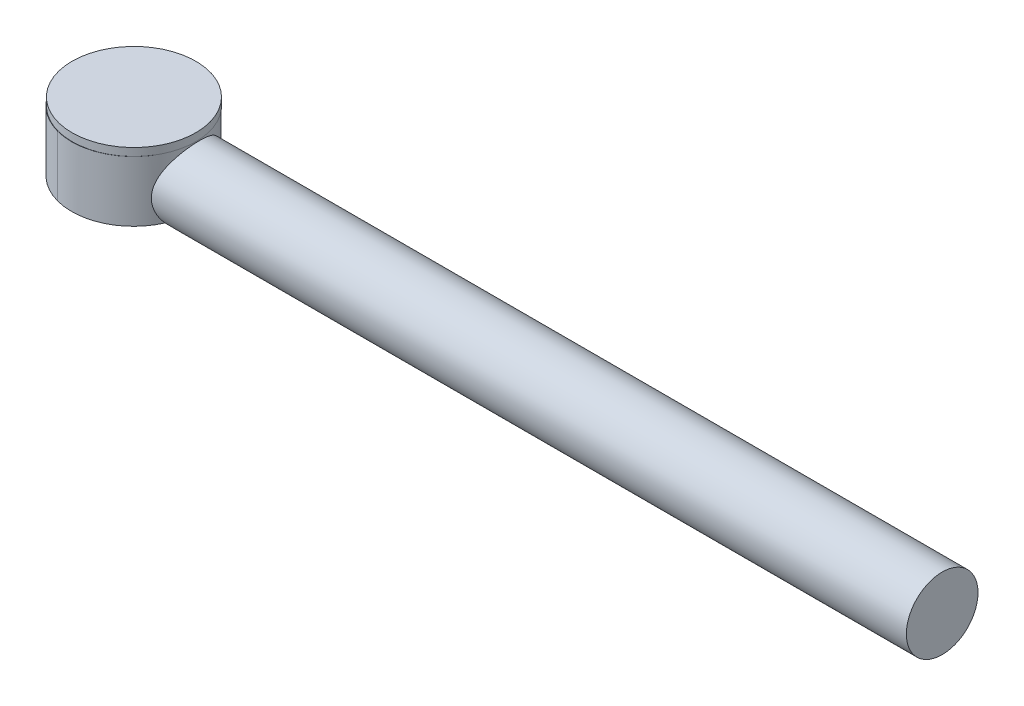
ISO-10303-21;
HEADER;
FILE_DESCRIPTION(('STEP AP214'),'2;1');
FILE_NAME('part.step','',(''),(''),'','','');
FILE_SCHEMA(('AUTOMOTIVE_DESIGN { 1 0 10303 214 1 1 1 1 }'));
ENDSEC;
DATA;
#1=APPLICATION_CONTEXT('core data for automotive mechanical design processes');
#2=APPLICATION_PROTOCOL_DEFINITION('international standard','automotive_design',2000,#1);
#3=PRODUCT_CONTEXT('',#1,'mechanical');
#4=PRODUCT('Part','Part','',(#3));
#5=PRODUCT_RELATED_PRODUCT_CATEGORY('part','',(#4));
#6=PRODUCT_DEFINITION_FORMATION('','',#4);
#7=PRODUCT_DEFINITION_CONTEXT('part definition',#1,'design');
#8=PRODUCT_DEFINITION('design','',#6,#7);
#9=PRODUCT_DEFINITION_SHAPE('','',#8);
#10=(LENGTH_UNIT() NAMED_UNIT(*) SI_UNIT(.MILLI.,.METRE.));
#11=(NAMED_UNIT(*) PLANE_ANGLE_UNIT() SI_UNIT($,.RADIAN.));
#12=(NAMED_UNIT(*) SI_UNIT($,.STERADIAN.) SOLID_ANGLE_UNIT());
#13=UNCERTAINTY_MEASURE_WITH_UNIT(LENGTH_MEASURE(1.E-05),#10,'distance_accuracy_value','');
#14=(GEOMETRIC_REPRESENTATION_CONTEXT(3) GLOBAL_UNCERTAINTY_ASSIGNED_CONTEXT((#13)) GLOBAL_UNIT_ASSIGNED_CONTEXT((#10,
#11,#12)) REPRESENTATION_CONTEXT('',''));
#15=CARTESIAN_POINT('',(0.,0.,0.));
#16=DIRECTION('',(0.,0.,1.));
#17=DIRECTION('',(1.,0.,0.));
#18=AXIS2_PLACEMENT_3D('',#15,#16,#17);
#19=CARTESIAN_POINT('',(85.8455921537652,56.2711130740514,55.1663814754269));
#20=DIRECTION('',(0.,-1.,0.));
#21=DIRECTION('',(0.,0.,-1.));
#22=AXIS2_PLACEMENT_3D('',#19,#20,#21);
#23=PLANE('',#22);
#24=CARTESIAN_POINT('',(85.8451387170964,56.2711130740514,55.1680444543631));
#25=DIRECTION('',(0.,1.,0.));
#26=DIRECTION('',(0.,0.,1.));
#27=AXIS2_PLACEMENT_3D('',#24,#25,#26);
#28=CIRCLE('',#27,0.00172368899597669);
#29=CARTESIAN_POINT('',(85.8451387170964,56.2711130740514,55.1697681433591));
#30=VERTEX_POINT('',#29);
#31=EDGE_CURVE('E141',#30,#30,#28,.T.);
#32=ORIENTED_EDGE('',*,*,#31,.F.);
#33=EDGE_LOOP('',(#32));
#34=FACE_BOUND('',#33,.T.);
#35=ADVANCED_FACE('F39',(#34),#23,.T.);
#36=CARTESIAN_POINT('',(85.8455921537652,56.2711130740514,55.1663814754269));
#37=DIRECTION('',(0.,-1.,0.));
#38=DIRECTION('',(0.,0.,-1.));
#39=AXIS2_PLACEMENT_3D('',#36,#37,#38);
#40=CYLINDRICAL_SURFACE('',#39,3.46216045673487);
#41=CARTESIAN_POINT('',(85.8455921537652,56.2711130740514,55.1663814754269));
#42=DIRECTION('',(0.,1.,0.));
#43=DIRECTION('',(0.263061764545742,0.,-0.964778994399277));
#44=AXIS2_PLACEMENT_3D('',#41,#42,#43);
#45=CIRCLE('',#44,3.46216045673486);
#46=CARTESIAN_POINT('',(86.7563541926543,56.2711130740514,51.8261617915293));
#47=VERTEX_POINT('',#46);
#48=EDGE_CURVE('E49',#47,#47,#45,.T.);
#49=ORIENTED_EDGE('',*,*,#48,.T.);
#50=EDGE_LOOP('',(#49));
#51=FACE_BOUND('',#50,.T.);
#52=CARTESIAN_POINT('',(85.8451387170964,52.6498767005646,58.6319286000939));
#53=CARTESIAN_POINT('',(85.9022781431992,52.6498767005646,58.6319330171962));
#54=CARTESIAN_POINT('',(85.9594204812359,52.6498767005646,58.6305673819269));
#55=CARTESIAN_POINT('',(86.0731646435422,52.6498767005646,58.6250696449926));
#56=CARTESIAN_POINT('',(86.1297674244005,52.6498767005646,58.6209572593628));
#57=CARTESIAN_POINT('',(86.242433194291,52.6498767005646,58.6099670734729));
#58=CARTESIAN_POINT('',(86.2984974702433,52.6498767005646,58.6031025163872));
#59=CARTESIAN_POINT('',(86.4100855726197,52.6498767005646,58.5866160643179));
#60=CARTESIAN_POINT('',(86.4656103551575,52.6498767005646,58.577000643534));
#61=CARTESIAN_POINT('',(86.5761200276653,52.6498767005646,58.5550189255727));
#62=CARTESIAN_POINT('',(86.6311048484214,52.6498767005646,58.5426522804193));
#63=CARTESIAN_POINT('',(86.7405357546421,52.6498767005646,58.5151752339513));
#64=CARTESIAN_POINT('',(86.7949800745156,52.6498767005646,58.5000578046358));
#65=CARTESIAN_POINT('',(86.9033316769709,52.6498767005646,58.4670852210716));
#66=CARTESIAN_POINT('',(86.9572348863243,52.6498767005646,58.4492166918067));
#67=CARTESIAN_POINT('',(87.0645071672621,52.6498767005646,58.4107503889644));
#68=CARTESIAN_POINT('',(87.1178693461341,52.6498767005646,58.3901334190223));
#69=CARTESIAN_POINT('',(87.2234828832721,52.6498767005646,58.3464067061153));
#70=CARTESIAN_POINT('',(87.2757355707485,52.6498767005646,58.3233001740664));
#71=CARTESIAN_POINT('',(87.3786873165212,52.6498767005646,58.2747271425663));
#72=CARTESIAN_POINT('',(87.4293946827911,52.6498767005646,58.2492782721121));
#73=CARTESIAN_POINT('',(87.5292579193038,52.6498767005646,58.1960289301901));
#74=CARTESIAN_POINT('',(87.5784198944581,52.6498767005646,58.1682399124995));
#75=CARTESIAN_POINT('',(87.6751945823478,52.6498767005646,58.1103159826552));
#76=CARTESIAN_POINT('',(87.7228104810345,52.6498767005646,58.0801863947181));
#77=CARTESIAN_POINT('',(87.8164960939139,52.6498767005646,58.0175876208643));
#78=CARTESIAN_POINT('',(87.8625654138706,52.6498767005646,57.9851178449527));
#79=CARTESIAN_POINT('',(87.953161687794,52.6498767005646,57.9178447103025));
#80=CARTESIAN_POINT('',(87.9976841056925,52.6498767005646,57.8830352444508));
#81=CARTESIAN_POINT('',(88.0851903880118,52.6498767005646,57.8110875939322));
#82=CARTESIAN_POINT('',(88.1281651419152,52.6498767005646,57.7739383335595));
#83=CARTESIAN_POINT('',(88.2125823553953,52.6498767005646,57.6973181266199));
#84=CARTESIAN_POINT('',(88.2540108672816,52.6498767005646,57.6578318261505));
#85=CARTESIAN_POINT('',(88.3348689748557,52.6498767005646,57.5769985280609));
#86=CARTESIAN_POINT('',(88.3743018829821,52.6498767005646,57.5356548442848));
#87=CARTESIAN_POINT('',(88.4508289493643,52.6498767005646,57.4513814368172));
#88=CARTESIAN_POINT('',(88.4879375313423,52.6498767005646,57.4084648226967));
#89=CARTESIAN_POINT('',(88.5598214507882,52.6498767005646,57.321052799695));
#90=CARTESIAN_POINT('',(88.5946068113079,52.6498767005646,57.2765656361548));
#91=CARTESIAN_POINT('',(88.6618484470639,52.6498767005646,57.1860168438093));
#92=CARTESIAN_POINT('',(88.6943097032658,52.6498767005646,57.1399589147686));
#93=CARTESIAN_POINT('',(88.7569084070072,52.6498767005646,57.0462732541047));
#94=CARTESIAN_POINT('',(88.7870452645401,52.6498767005646,56.9986451282661));
#95=CARTESIAN_POINT('',(88.8450009944314,52.6498767005646,56.9018231637735));
#96=CARTESIAN_POINT('',(88.8728133389145,52.6498767005646,56.8526254187572));
#97=CARTESIAN_POINT('',(88.9261254280582,52.6498767005646,56.7526672523529));
#98=CARTESIAN_POINT('',(88.9516125172107,52.6498767005646,56.7019000847931));
#99=CARTESIAN_POINT('',(89.0002825692125,52.6498767005646,56.5988071748745));
#100=CARTESIAN_POINT('',(89.0234467703912,52.6498767005646,56.5464725849089));
#101=CARTESIAN_POINT('',(89.0672163570395,52.6498767005646,56.4408492971016));
#102=CARTESIAN_POINT('',(89.0878260709565,52.6498767005646,56.3875623932372));
#103=CARTESIAN_POINT('',(89.1262778244476,52.6498767005646,56.280418276514));
#104=CARTESIAN_POINT('',(89.1441382066191,52.6498767005646,56.2265676556));
#105=CARTESIAN_POINT('',(89.1770991555188,52.6498767005646,56.1183006916261));
#106=CARTESIAN_POINT('',(89.1922121376947,52.6498767005646,56.0638881306124));
#107=CARTESIAN_POINT('',(89.2196837860514,52.6498767005646,55.9544996947017));
#108=CARTESIAN_POINT('',(89.2320484698829,52.6498767005646,55.8995253318088));
#109=CARTESIAN_POINT('',(89.254030180845,52.6498767005646,55.7890155806221));
#110=CARTESIAN_POINT('',(89.2636465120209,52.6498767005646,55.7334800539067));
#111=CARTESIAN_POINT('',(89.2801384629587,52.6498767005646,55.6218495249747));
#112=CARTESIAN_POINT('',(89.2870065568503,52.6498767005646,55.5657534118598));
#113=CARTESIAN_POINT('',(89.2980081706328,52.6498767005646,55.4530024545521));
#114=CARTESIAN_POINT('',(89.3021274167108,52.6498767005646,55.3963462207625));
#115=CARTESIAN_POINT('',(89.307640732981,52.6498767005646,55.2824755687892));
#116=CARTESIAN_POINT('',(89.3090140838173,52.6498767005646,55.2252601562631));
#117=CARTESIAN_POINT('',(89.309031626752,52.6498767005646,55.1109270668505));
#118=CARTESIAN_POINT('',(89.3076805043397,52.6498767005646,55.0538093909576));
#119=CARTESIAN_POINT('',(89.3022030140336,52.6498767005646,54.9401062854821));
#120=CARTESIAN_POINT('',(89.2980961151182,52.6498767005646,54.8835199266539));
#121=CARTESIAN_POINT('',(89.2871160877933,52.6498767005646,54.7708806855327));
#122=CARTESIAN_POINT('',(89.2802558770882,52.6498767005646,54.7148265462084));
#123=CARTESIAN_POINT('',(89.2637752286139,52.6498767005646,54.6032518644914));
#124=CARTESIAN_POINT('',(89.2541609290478,52.6498767005646,54.547730416153));
#125=CARTESIAN_POINT('',(89.2321791310013,52.6498767005646,54.4372206822885));
#126=CARTESIAN_POINT('',(89.2198109365709,52.6498767005646,54.3822325352077));
#127=CARTESIAN_POINT('',(89.1923283585253,52.6498767005646,54.2727881779326));
#128=CARTESIAN_POINT('',(89.17720659679,52.6498767005646,54.2183338214279));
#129=CARTESIAN_POINT('',(89.1442228392435,52.6498767005646,54.1099553843763));
#130=CARTESIAN_POINT('',(89.1263471243729,52.6498767005646,54.0560354823608));
#131=CARTESIAN_POINT('',(89.0878643524888,52.6498767005646,53.9487228628546));
#132=CARTESIAN_POINT('',(89.067237772768,52.6498767005646,53.8953371556654));
#133=CARTESIAN_POINT('',(89.0235006012374,52.6498767005646,53.7897004410775));
#134=CARTESIAN_POINT('',(89.0003943386356,52.6498767005646,53.7374476415377));
#135=CARTESIAN_POINT('',(88.9518215027788,52.6498767005646,53.6344958143968));
#136=CARTESIAN_POINT('',(88.9263725609076,52.6498767005646,53.5837884778295));
#137=CARTESIAN_POINT('',(88.8731231669847,52.6498767005646,53.4839252629441));
#138=CARTESIAN_POINT('',(88.8453341682908,52.6498767005646,53.4347632798891));
#139=CARTESIAN_POINT('',(88.7874102523185,52.6498767005646,53.3379885862301));
#140=CARTESIAN_POINT('',(88.75728065931,52.6498767005646,53.2903726896526));
#141=CARTESIAN_POINT('',(88.694681881742,52.6498767005646,53.196687078318));
#142=CARTESIAN_POINT('',(88.6622121071893,52.6498767005646,53.1506177577961));
#143=CARTESIAN_POINT('',(88.5949389735371,52.6498767005646,53.0600214834575));
#144=CARTESIAN_POINT('',(88.5601295073198,52.6498767005646,53.0154990657111));
#145=CARTESIAN_POINT('',(88.4881818565317,52.6498767005646,52.9279927835037));
#146=CARTESIAN_POINT('',(88.4510325962575,52.6498767005646,52.8850180295593));
#147=CARTESIAN_POINT('',(88.3744123893903,52.6498767005646,52.8006008160489));
#148=CARTESIAN_POINT('',(88.3349260888938,52.6498767005646,52.7591723041737));
#149=CARTESIAN_POINT('',(88.2540927907836,52.6498767005646,52.6783141966072));
#150=CARTESIAN_POINT('',(88.2127491070137,52.6498767005646,52.6388812884772));
#151=CARTESIAN_POINT('',(88.1284756995498,52.6498767005646,52.5623542220918));
#152=CARTESIAN_POINT('',(88.0855590854267,52.6498767005646,52.5252456401141));
#153=CARTESIAN_POINT('',(87.9981470624226,52.6498767005646,52.453361720668));
#154=CARTESIAN_POINT('',(87.9536598988826,52.6498767005646,52.4185763601479));
#155=CARTESIAN_POINT('',(87.863111106537,52.6498767005646,52.3513347243913));
#156=CARTESIAN_POINT('',(87.817053177496,52.6498767005646,52.3188734681894));
#157=CARTESIAN_POINT('',(87.723367516832,52.6498767005646,52.2562747644481));
#158=CARTESIAN_POINT('',(87.6757393909936,52.6498767005646,52.2261379069152));
#159=CARTESIAN_POINT('',(87.5789174265014,52.6498767005646,52.1681821770242));
#160=CARTESIAN_POINT('',(87.5297196814855,52.6498767005646,52.1403698325414));
#161=CARTESIAN_POINT('',(87.4297615150823,52.6498767005646,52.0870577433985));
#162=CARTESIAN_POINT('',(87.3789943475231,52.6498767005646,52.0615706542463));
#163=CARTESIAN_POINT('',(87.275901437606,52.6498767005646,52.0129006022457));
#164=CARTESIAN_POINT('',(87.2235668476413,52.6498767005646,51.9897364010676));
#165=CARTESIAN_POINT('',(87.1179435598343,52.6498767005646,51.9459668144199));
#166=CARTESIAN_POINT('',(87.0646566559692,52.6498767005646,51.9253571005029));
#167=CARTESIAN_POINT('',(86.9575125392449,52.6498767005646,51.8869053470118));
#168=CARTESIAN_POINT('',(86.9036619183304,52.6498767005646,51.8690449648403));
#169=CARTESIAN_POINT('',(86.7953949543559,52.6498767005646,51.8360840159406));
#170=CARTESIAN_POINT('',(86.7409823933419,52.6498767005646,51.8209710337647));
#171=CARTESIAN_POINT('',(86.6315939574309,52.6498767005646,51.7934993854081));
#172=CARTESIAN_POINT('',(86.5766195945379,52.6498767005646,51.7811347015765));
#173=CARTESIAN_POINT('',(86.4661098433512,52.6498767005646,51.7591529906144));
#174=CARTESIAN_POINT('',(86.4105743166359,52.6498767005646,51.7495366594386));
#175=CARTESIAN_POINT('',(86.2989437877042,52.6498767005646,51.7330447085007));
#176=CARTESIAN_POINT('',(86.2428476745896,52.6498767005646,51.7261766146092));
#177=CARTESIAN_POINT('',(86.1300967172826,52.6498767005646,51.7151750008267));
#178=CARTESIAN_POINT('',(86.0734404834934,52.6498767005646,51.7110557547486));
#179=CARTESIAN_POINT('',(85.9595698315213,52.6498767005646,51.7055424384785));
#180=CARTESIAN_POINT('',(85.9023544189958,52.6498767005646,51.7041690876421));
#181=CARTESIAN_POINT('',(85.7880213295831,52.6498767005646,51.7041515447074));
#182=CARTESIAN_POINT('',(85.7309036536896,52.6498767005646,51.7055026671197));
#183=CARTESIAN_POINT('',(85.617200548213,52.6498767005646,51.7109801574258));
#184=CARTESIAN_POINT('',(85.5606141893845,52.6498767005646,51.7150870563412));
#185=CARTESIAN_POINT('',(85.4479749482625,52.6498767005646,51.7260670836661));
#186=CARTESIAN_POINT('',(85.3919208089379,52.6498767005646,51.7329272943712));
#187=CARTESIAN_POINT('',(85.2803461272205,52.6498767005646,51.7494079428455));
#188=CARTESIAN_POINT('',(85.2248246788821,52.6498767005646,51.7590222424116));
#189=CARTESIAN_POINT('',(85.1143149450176,52.6498767005646,51.7810040404581));
#190=CARTESIAN_POINT('',(85.0593267979369,52.6498767005646,51.7933722348885));
#191=CARTESIAN_POINT('',(84.9498824406621,52.6498767005646,51.8208548129341));
#192=CARTESIAN_POINT('',(84.8954280841577,52.6498767005646,51.8359765746694));
#193=CARTESIAN_POINT('',(84.7870496471067,52.6498767005646,51.8689603322159));
#194=CARTESIAN_POINT('',(84.7331297450917,52.6498767005646,51.8868360470864));
#195=CARTESIAN_POINT('',(84.6258171255866,52.6498767005646,51.9253188189706));
#196=CARTESIAN_POINT('',(84.572431418398,52.6498767005646,51.9459453986915));
#197=CARTESIAN_POINT('',(84.4667947038108,52.6498767005646,51.9896825702223));
#198=CARTESIAN_POINT('',(84.414541904271,52.6498767005646,52.0127888328243));
#199=CARTESIAN_POINT('',(84.3115900771301,52.6498767005646,52.0613616686816));
#200=CARTESIAN_POINT('',(84.2608827405628,52.6498767005646,52.086810610553));
#201=CARTESIAN_POINT('',(84.1610195256774,52.6498767005646,52.1400600044762));
#202=CARTESIAN_POINT('',(84.1118575426224,52.6498767005646,52.1678490031702));
#203=CARTESIAN_POINT('',(84.0150828489634,52.6498767005646,52.2257729191427));
#204=CARTESIAN_POINT('',(83.9674669523859,52.6498767005646,52.2559025121512));
#205=CARTESIAN_POINT('',(83.8737813410513,52.6498767005646,52.3185012897192));
#206=CARTESIAN_POINT('',(83.8277120205294,52.6498767005646,52.3509710642718));
#207=CARTESIAN_POINT('',(83.7371157461908,52.6498767005646,52.4182441979239));
#208=CARTESIAN_POINT('',(83.6925933284444,52.6498767005646,52.4530536641411));
#209=CARTESIAN_POINT('',(83.605087046237,52.6498767005646,52.5250013149289));
#210=CARTESIAN_POINT('',(83.5621122922926,52.6498767005646,52.5621505752029));
#211=CARTESIAN_POINT('',(83.4776950787822,52.6498767005646,52.6387707820697));
#212=CARTESIAN_POINT('',(83.436266566907,52.6498767005646,52.6782570825659));
#213=CARTESIAN_POINT('',(83.3554084593411,52.6498767005646,52.759090380675));
#214=CARTESIAN_POINT('',(83.3159755512117,52.6498767005646,52.800434064444));
#215=CARTESIAN_POINT('',(83.2394484848274,52.6498767005646,52.8847074719063));
#216=CARTESIAN_POINT('',(83.2023399028502,52.6498767005646,52.9276240860288));
#217=CARTESIAN_POINT('',(83.1304559834048,52.6498767005646,53.0150361090319));
#218=CARTESIAN_POINT('',(83.0956706228849,52.6498767005646,53.0595232725715));
#219=CARTESIAN_POINT('',(83.0284289871287,52.6498767005646,53.1500720649166));
#220=CARTESIAN_POINT('',(82.9959677309269,52.6498767005646,53.1961299939574));
#221=CARTESIAN_POINT('',(82.9333690271855,52.6498767005646,53.2898156546215));
#222=CARTESIAN_POINT('',(82.9032321696526,52.6498767005646,53.33744378046));
#223=CARTESIAN_POINT('',(82.8452764397613,52.6498767005646,53.4342657449527));
#224=CARTESIAN_POINT('',(82.8174640952782,52.6498767005646,53.483463489969));
#225=CARTESIAN_POINT('',(82.7641520061346,52.6498767005646,53.5834216563732));
#226=CARTESIAN_POINT('',(82.738664916982,52.6498767005646,53.6341888239331));
#227=CARTESIAN_POINT('',(82.6899948649802,52.6498767005646,53.7372817338517));
#228=CARTESIAN_POINT('',(82.6668306638015,52.6498767005646,53.7896163238173));
#229=CARTESIAN_POINT('',(82.6230610771532,52.6498767005646,53.8952396116245));
#230=CARTESIAN_POINT('',(82.6024513632362,52.6498767005646,53.948526515489));
#231=CARTESIAN_POINT('',(82.5639996097451,52.6498767005646,54.0556706322121));
#232=CARTESIAN_POINT('',(82.5461392275736,52.6498767005646,54.1095212531262));
#233=CARTESIAN_POINT('',(82.5131782786739,52.6498767005646,54.2177882171));
#234=CARTESIAN_POINT('',(82.498065296498,52.6498767005646,54.2722007781138));
#235=CARTESIAN_POINT('',(82.4705936481413,52.6498767005646,54.3815892140244));
#236=CARTESIAN_POINT('',(82.4582289643098,52.6498767005646,54.4365635769174));
#237=CARTESIAN_POINT('',(82.4362472533477,52.6498767005646,54.547073328104));
#238=CARTESIAN_POINT('',(82.4266309221718,52.6498767005646,54.6026088548194));
#239=CARTESIAN_POINT('',(82.410138971234,52.6498767005646,54.7142393837514));
#240=CARTESIAN_POINT('',(82.4032708773424,52.6498767005646,54.7703354968664));
#241=CARTESIAN_POINT('',(82.3922692635599,52.6498767005646,54.883086454174));
#242=CARTESIAN_POINT('',(82.3881500174819,52.6498767005646,54.9397426879637));
#243=CARTESIAN_POINT('',(82.3826367012117,52.6498767005646,55.0536133399369));
#244=CARTESIAN_POINT('',(82.3812633503754,52.6498767005646,55.1108287524631));
#245=CARTESIAN_POINT('',(82.3812458074407,52.6498767005646,55.2251618418759));
#246=CARTESIAN_POINT('',(82.382596929853,52.6498767005646,55.2822795177691));
#247=CARTESIAN_POINT('',(82.3880744201591,52.6498767005646,55.3959826232451));
#248=CARTESIAN_POINT('',(82.3921813190745,52.6498767005646,55.4525689820734));
#249=CARTESIAN_POINT('',(82.4031613463994,52.6498767005646,55.5652082231949));
#250=CARTESIAN_POINT('',(82.4100215571045,52.6498767005646,55.6212623625194));
#251=CARTESIAN_POINT('',(82.4265022055788,52.6498767005646,55.7328370442365));
#252=CARTESIAN_POINT('',(82.4361165051449,52.6498767005646,55.7883584925749));
#253=CARTESIAN_POINT('',(82.4580983031914,52.6498767005646,55.8988682264394));
#254=CARTESIAN_POINT('',(82.4704664976218,52.6498767005646,55.9538563735201));
#255=CARTESIAN_POINT('',(82.4979490756674,52.6498767005646,56.0633007307951));
#256=CARTESIAN_POINT('',(82.5130708374027,52.6498767005646,56.1177550872996));
#257=CARTESIAN_POINT('',(82.5460545949492,52.6498767005646,56.226133524351));
#258=CARTESIAN_POINT('',(82.5639303098198,52.6498767005646,56.2800534263663));
#259=CARTESIAN_POINT('',(82.6024130817039,52.6498767005646,56.3873660458721));
#260=CARTESIAN_POINT('',(82.6230396614248,52.6498767005646,56.4407517530611));
#261=CARTESIAN_POINT('',(82.6667768329555,52.6498767005646,56.5463884676488));
#262=CARTESIAN_POINT('',(82.6898830955575,52.6498767005646,56.5986412671888));
#263=CARTESIAN_POINT('',(82.7384559314146,52.6498767005646,56.70159309433));
#264=CARTESIAN_POINT('',(82.763904873286,52.6498767005646,56.7523004308974));
#265=CARTESIAN_POINT('',(82.817154267209,52.6498767005646,56.8521636457831));
#266=CARTESIAN_POINT('',(82.844943265903,52.6498767005646,56.9013256288381));
#267=CARTESIAN_POINT('',(82.9028671818755,52.6498767005646,56.9981003224972));
#268=CARTESIAN_POINT('',(82.932996774884,52.6498767005646,57.0457162190747));
#269=CARTESIAN_POINT('',(82.9955955524519,52.6498767005646,57.1394018304095));
#270=CARTESIAN_POINT('',(83.0280653270045,52.6498767005646,57.1854711509314));
#271=CARTESIAN_POINT('',(83.0953384606568,52.6498767005646,57.2760674252695));
#272=CARTESIAN_POINT('',(83.1301479268742,52.6498767005646,57.3205898430154));
#273=CARTESIAN_POINT('',(83.2020955776615,52.6498767005646,57.408096125224));
#274=CARTESIAN_POINT('',(83.2392448379348,52.6498767005646,57.4510708791702));
#275=CARTESIAN_POINT('',(83.3158650448039,52.6498767005646,57.535488092675));
#276=CARTESIAN_POINT('',(83.3553513453032,52.6498767005646,57.5769166045428));
#277=CARTESIAN_POINT('',(83.4361846434046,52.6498767005646,57.6577747121283));
#278=CARTESIAN_POINT('',(83.4775283271629,52.6498767005646,57.6972076202847));
#279=CARTESIAN_POINT('',(83.5618017346564,52.6498767005646,57.7737346865964));
#280=CARTESIAN_POINT('',(83.6047183488204,52.6498767005646,57.8108432684749));
#281=CARTESIAN_POINT('',(83.6921303717115,52.6498767005646,57.8827271881902));
#282=CARTESIAN_POINT('',(83.7366175350986,52.6498767005646,57.9175125490765));
#283=CARTESIAN_POINT('',(83.8271663278612,52.6498767005646,57.9847541838321));
#284=CARTESIAN_POINT('',(83.8732242574704,52.6498767005646,58.0172154386707));
#285=CARTESIAN_POINT('',(83.9669099165809,52.6498767005646,58.0798141461386));
#286=CARTESIAN_POINT('',(84.0145380402969,52.6498767005646,58.109951008763));
#287=CARTESIAN_POINT('',(84.1113600105958,52.6498767005646,58.1679067247254));
#288=CARTESIAN_POINT('',(84.1605577635683,52.6498767005646,58.1957190501225));
#289=CARTESIAN_POINT('',(84.2605159081889,52.6498767005646,58.2490311915197));
#290=CARTESIAN_POINT('',(84.3112830458143,52.6498767005646,58.2745183524782));
#291=CARTESIAN_POINT('',(84.4143760377466,52.6498767005646,58.3231882077428));
#292=CARTESIAN_POINT('',(84.4667107407288,52.6498767005646,58.3463521378158));
#293=CARTESIAN_POINT('',(84.5723572245587,52.6498767005646,58.390132203654));
#294=CARTESIAN_POINT('',(84.6256676760693,52.6498767005646,58.4107515468084));
#295=CARTESIAN_POINT('',(84.7328521664621,52.6498767005646,58.4492198034285));
#296=CARTESIAN_POINT('',(84.7867194949819,52.6498767005646,58.4670873878519));
#297=CARTESIAN_POINT('',(84.8950133139161,52.6498767005646,58.5000595261592));
#298=CARTESIAN_POINT('',(84.9494359167319,52.6498767005646,58.5151768404915));
#299=CARTESIAN_POINT('',(85.0588378245983,52.6498767005646,58.5426540550997));
#300=CARTESIAN_POINT('',(85.1138155293695,52.6498767005646,58.5550203236229));
#301=CARTESIAN_POINT('',(85.2243253074839,52.6498767005646,58.5770020258431));
#302=CARTESIAN_POINT('',(85.2798574500392,52.6498767005646,58.5866171115437));
#303=CARTESIAN_POINT('',(85.3914746761229,52.6498767005646,58.6031035801116));
#304=CARTESIAN_POINT('',(85.447560821001,52.6498767005646,58.609967773859));
#305=CARTESIAN_POINT('',(85.5602847423708,52.6498767005646,58.6209579624449));
#306=CARTESIAN_POINT('',(85.6169238744803,52.6498767005646,58.625069997536));
#307=CARTESIAN_POINT('',(85.7307552579135,52.6498767005646,58.6305677194748));
#308=CARTESIAN_POINT('',(85.7879484991647,52.6498767005646,58.6319329905889));
#309=CARTESIAN_POINT('',(85.8451387170964,52.6498767005646,58.6319286000939));
#310=B_SPLINE_CURVE_WITH_KNOTS('',3,(#52,#53,#54,#55,#56,#57,#58,#59,#60,#61,#62,#63,#64,#65,
#66,#67,#68,#69,#70,#71,#72,#73,#74,#75,#76,#77,#78,#79,#80,#81,#82,#83,#84,#85,#86,#87,#88,#89,
#90,#91,#92,#93,#94,#95,#96,#97,#98,#99,#100,#101,#102,#103,#104,#105,#106,#107,#108,#109,#110,
#111,#112,#113,#114,#115,#116,#117,#118,#119,#120,#121,#122,#123,#124,#125,#126,#127,#128,#129,
#130,#131,#132,#133,#134,#135,#136,#137,#138,#139,#140,#141,#142,#143,#144,#145,#146,#147,#148,
#149,#150,#151,#152,#153,#154,#155,#156,#157,#158,#159,#160,#161,#162,#163,#164,#165,#166,#167,
#168,#169,#170,#171,#172,#173,#174,#175,#176,#177,#178,#179,#180,#181,#182,#183,#184,#185,#186,
#187,#188,#189,#190,#191,#192,#193,#194,#195,#196,#197,#198,#199,#200,#201,#202,#203,#204,#205,
#206,#207,#208,#209,#210,#211,#212,#213,#214,#215,#216,#217,#218,#219,#220,#221,#222,#223,#224,
#225,#226,#227,#228,#229,#230,#231,#232,#233,#234,#235,#236,#237,#238,#239,#240,#241,#242,#243,
#244,#245,#246,#247,#248,#249,#250,#251,#252,#253,#254,#255,#256,#257,#258,#259,#260,#261,#262,
#263,#264,#265,#266,#267,#268,#269,#270,#271,#272,#273,#274,#275,#276,#277,#278,#279,#280,#281,
#282,#283,#284,#285,#286,#287,#288,#289,#290,#291,#292,#293,#294,#295,#296,#297,#298,#299,#300,
#301,#302,#303,#304,#305,#306,#307,#308,#309),.UNSPECIFIED.,.F.,.F.,(4,2,2,2,2,2,2,2,2,2,2,2,2,
2,2,2,2,2,2,2,2,2,2,2,2,2,2,2,2,2,2,2,2,2,2,2,2,2,2,2,2,2,2,2,2,2,2,2,2,2,2,2,2,2,2,2,2,2,2,2,2,
2,2,2,2,2,2,2,2,2,2,2,2,2,2,2,2,2,2,2,2,2,2,2,2,2,2,2,2,2,2,2,2,2,2,2,2,2,2,2,2,2,2,2,2,2,2,2,2,
2,2,2,2,2,2,2,2,2,2,2,2,2,2,2,2,2,2,2,4),(0.,0.171406034270473,0.341594760706496,
0.51097420050286,0.679958237156565,0.848963659140803,1.01840709712114,1.18870196694212,
1.36025552912706,1.53159042017548,1.70172743527465,1.87107537987785,2.04004878664351,
2.20906494405116,2.37854082479497,2.54889002573566,2.72051983021773,2.89185472126497,
3.06199173636329,3.23133968096597,3.40031308773145,3.56932924513927,3.73880512588364,
3.90915432682524,4.08078413130861,4.25211902235761,4.42225603745717,4.5916039820606,
4.76057738882633,4.92959354623392,5.09906942697754,5.26941862791793,5.44104843239962,
5.61238332344792,5.78252033854701,5.95186828315017,6.12084168991581,6.28985784732348,
6.45933372806734,6.62968292900808,6.80131273349024,6.97264762453835,7.14278463963727,
7.31213258424031,7.48110599100591,7.65012214841362,7.81959802915763,7.98994723009868,
8.16157703458128,8.33291192563176,8.50304894073239,8.67239688533646,8.84137029210241,
9.01038644950978,9.17986233025275,9.35021153119205,9.52184133567223,9.69317622672298,
9.86331324182382,10.032661186428,10.201634593194,10.3706507506013,10.5401266313442,
10.7104758322832,10.882105636763,11.0534405278132,11.2235775429136,11.3929254875176,
11.5618988942835,11.7309150516909,11.900390932434,12.0707401333735,12.2423699378539,
12.4137048289023,12.5838418440015,12.7531897886047,12.9221631953703,13.091179352778,
13.2606552335218,13.4310044344625,13.6026342389445,13.7739691299918,13.9441061450901,
14.1134540896928,14.2824274964583,14.4514436538661,14.6209195346105,14.791268735552,
14.9628985400354,15.1342334310844,15.304370446184,15.4737183907874,15.6426917975531,
15.8117079549607,15.9811838357044,16.1515330366447,16.3231628411264,16.4944977321755,
16.6646347472752,16.8339826918786,17.0029560986444,17.171972256052,17.3414481367955,
17.5117973377357,17.6834271422171,17.854762033266,18.0248990483654,18.1942469929688,
18.3632203997345,18.5322365571421,18.7017124378858,18.8720616388263,19.0436914433081,
19.2150263343567,19.385163349456,19.5545112940592,19.7234847008249,19.8925008582325,
20.0619767389763,20.2323259399169,20.4039557443988,20.5753669548362,20.7455583552642,
20.9149387742715,21.0839229266467,21.2529284443442,21.4223728013403,21.5926702442772,
21.7642288403056),.UNSPECIFIED.);
#311=CARTESIAN_POINT('',(85.8451387170964,52.6498767005646,58.6319286000939));
#312=VERTEX_POINT('',#311);
#313=EDGE_CURVE('E246',#312,#312,#310,.T.);
#314=ORIENTED_EDGE('',*,*,#313,.F.);
#315=EDGE_LOOP('',(#314));
#316=FACE_BOUND('',#315,.T.);
#317=ADVANCED_FACE('F232',(#51,#316),#40,.F.);
#318=CARTESIAN_POINT('',(137.955983550691,54.1716158859326,55.0681390481877));
#319=DIRECTION('',(1.,0.,0.));
#320=DIRECTION('',(0.,0.,-1.));
#321=AXIS2_PLACEMENT_3D('',#318,#319,#320);
#322=PLANE('',#321);
#323=CARTESIAN_POINT('',(137.955983550691,54.1716158859326,55.0681390481877));
#324=DIRECTION('',(1.,0.,0.));
#325=DIRECTION('',(0.,0.,-1.));
#326=AXIS2_PLACEMENT_3D('',#323,#324,#325);
#327=CIRCLE('',#326,2.31365217276674);
#328=CARTESIAN_POINT('',(137.955983550691,54.1716158859326,52.754486875421));
#329=VERTEX_POINT('',#328);
#330=EDGE_CURVE('E273',#329,#329,#327,.T.);
#331=ORIENTED_EDGE('',*,*,#330,.T.);
#332=EDGE_LOOP('',(#331));
#333=FACE_BOUND('',#332,.T.);
#334=ADVANCED_FACE('F225',(#333),#322,.T.);
#335=CARTESIAN_POINT('',(85.8451387170964,57.3338139318963,55.1680444543631));
#336=DIRECTION('',(0.,-1.,0.));
#337=DIRECTION('',(0.,0.,-1.));
#338=AXIS2_PLACEMENT_3D('',#335,#336,#337);
#339=CYLINDRICAL_SURFACE('',#338,4.41488839314275);
#340=CARTESIAN_POINT('',(85.8451387170964,52.6498767005646,55.1680444543631));
#341=DIRECTION('',(0.,-1.,0.));
#342=DIRECTION('',(0.,0.,-1.));
#343=AXIS2_PLACEMENT_3D('',#340,#341,#342);
#344=CIRCLE('',#343,4.41488839314275);
#345=CARTESIAN_POINT('',(89.8570877583521,52.6498767005646,53.3253550029705));
#346=VERTEX_POINT('',#345);
#347=CARTESIAN_POINT('',(89.9429661050284,52.6498767005646,56.810923093405));
#348=VERTEX_POINT('',#347);
#349=EDGE_CURVE('E205',#346,#348,#344,.T.);
#350=ORIENTED_EDGE('',*,*,#349,.F.);
#351=CARTESIAN_POINT('',(89.9429661050284,52.6498767005646,56.810923093405));
#352=CARTESIAN_POINT('',(89.9598691618483,52.6016003833653,56.7687617533724));
#353=CARTESIAN_POINT('',(89.9768067955959,52.5550984496613,56.7246283098016));
#354=CARTESIAN_POINT('',(90.0103291865865,52.4658412597583,56.6325690599469));
#355=CARTESIAN_POINT('',(90.0269138220548,52.4230872811348,56.5846419710252));
#356=CARTESIAN_POINT('',(90.0755993602319,52.3005096451873,56.4350989422909));
#357=CARTESIAN_POINT('',(90.1065088979095,52.2267076482058,56.3280154246226));
#358=CARTESIAN_POINT('',(90.1618235556331,52.0973748785392,56.1013795489201));
#359=CARTESIAN_POINT('',(90.1862103653144,52.0418954400152,55.9817933742973));
#360=CARTESIAN_POINT('',(90.2254281017248,51.9518590970684,55.7337230064818));
#361=CARTESIAN_POINT('',(90.2402811026526,51.9172538726108,55.6052601362031));
#362=CARTESIAN_POINT('',(90.2578017621292,51.8723307268605,55.3534183138647));
#363=CARTESIAN_POINT('',(90.2613058487256,51.8603742627657,55.2303893826729));
#364=CARTESIAN_POINT('',(90.2579111270485,51.8562143034585,54.9841073262146));
#365=CARTESIAN_POINT('',(90.2510109297167,51.8640134458779,54.860854173207));
#366=CARTESIAN_POINT('',(90.2280666118155,51.8977738442603,54.6255276896892));
#367=CARTESIAN_POINT('',(90.2126043068301,51.9226013287298,54.513230385023));
#368=CARTESIAN_POINT('',(90.1742057401821,51.9880883900836,54.2946966816406));
#369=CARTESIAN_POINT('',(90.1512668847251,52.0287534623619,54.1884624013844));
#370=CARTESIAN_POINT('',(90.0982548552144,52.1270579813108,53.9786799608336));
#371=CARTESIAN_POINT('',(90.0678615316645,52.185500293576,53.8755920864951));
#372=CARTESIAN_POINT('',(90.0031077546218,52.3166317011211,53.680395712154));
#373=CARTESIAN_POINT('',(89.9687499623801,52.3893112618856,53.5882799302977));
#374=CARTESIAN_POINT('',(89.9210487476378,52.4969467631521,53.4711832581662));
#375=CARTESIAN_POINT('',(89.9082588355418,52.5264455469262,53.4408115007047));
#376=CARTESIAN_POINT('',(89.8826613139499,52.5869970260982,53.381796838938));
#377=CARTESIAN_POINT('',(89.8698537854115,52.6180466334873,53.3531507313034));
#378=CARTESIAN_POINT('',(89.8570877583521,52.6498767005646,53.3253550029705));
#379=B_SPLINE_CURVE_WITH_KNOTS('',3,(#351,#352,#353,#354,#355,#356,#357,#358,#359,#360,#361,
#362,#363,#364,#365,#366,#367,#368,#369,#370,#371,#372,#373,#374,#375,#376,#377,#378),
.UNSPECIFIED.,.F.,.F.,(4,2,2,2,2,2,2,2,2,2,2,2,2,4),(0.,0.198746322642274,0.397560131155452,
0.796564027129921,1.19667650861936,1.59585921179006,1.96485942895716,2.33390891507627,
2.68050697655425,3.02722540941497,3.39279986113569,3.75813032385048,3.89077198239731,
4.02315930678074),.UNSPECIFIED.);
#380=EDGE_CURVE('E175',#348,#346,#379,.T.);
#381=ORIENTED_EDGE('',*,*,#380,.F.);
#382=EDGE_LOOP('',(#350,#381));
#383=FACE_BOUND('',#382,.T.);
#384=ADVANCED_FACE('F221',(#383),#339,.F.);
#385=CARTESIAN_POINT('',(137.955983550691,54.1716158859326,55.0681390481877));
#386=DIRECTION('',(-1.,0.,0.));
#387=DIRECTION('',(0.,0.,1.));
#388=AXIS2_PLACEMENT_3D('',#385,#386,#387);
#389=CYLINDRICAL_SURFACE('',#388,2.31365217276674);
#390=ORIENTED_EDGE('',*,*,#330,.F.);
#391=EDGE_LOOP('',(#390));
#392=FACE_BOUND('',#391,.T.);
#393=CARTESIAN_POINT('',(89.4954774771804,52.6498767005646,56.810923093405));
#394=CARTESIAN_POINT('',(89.4590070959086,52.7439531886695,56.8930642463133));
#395=CARTESIAN_POINT('',(89.4224976170564,52.8448198490282,56.9677075817659));
#396=CARTESIAN_POINT('',(89.3532605097125,53.0590733863414,57.1006913360713));
#397=CARTESIAN_POINT('',(89.320563935248,53.172550105198,57.1589027245781));
#398=CARTESIAN_POINT('',(89.2633745792603,53.409978328677,57.2566123727102));
#399=CARTESIAN_POINT('',(89.2389177596325,53.5339728673882,57.2960289060753));
#400=CARTESIAN_POINT('',(89.2025914627776,53.7881982556527,57.353494285403));
#401=CARTESIAN_POINT('',(89.1906713069015,53.9184017552517,57.3716291956726));
#402=CARTESIAN_POINT('',(89.1820947106429,54.1657101593968,57.3847156029197));
#403=CARTESIAN_POINT('',(89.1838705493253,54.2826389412691,57.3820478660282));
#404=CARTESIAN_POINT('',(89.1987213271506,54.5141348096543,57.3592541383528));
#405=CARTESIAN_POINT('',(89.2118071870916,54.628699503933,57.3391112737591));
#406=CARTESIAN_POINT('',(89.2463856677294,54.8463749177602,57.2839150906157));
#407=CARTESIAN_POINT('',(89.2674142346923,54.9497717750419,57.2496768130426));
#408=CARTESIAN_POINT('',(89.3154159609968,55.1495565896683,57.1677308382468));
#409=CARTESIAN_POINT('',(89.342390075471,55.2459434175621,57.1200209765119));
#410=CARTESIAN_POINT('',(89.403680798428,55.4431932682409,57.0048525110084));
#411=CARTESIAN_POINT('',(89.4384969857469,55.5428405659075,56.9355778078344));
#412=CARTESIAN_POINT('',(89.5089478524433,55.7300241760106,56.7824870202407));
#413=CARTESIAN_POINT('',(89.5445832077391,55.8175500354792,56.6986585239521));
#414=CARTESIAN_POINT('',(89.6172791592876,55.9881267423963,56.5074092164656));
#415=CARTESIAN_POINT('',(89.6540387819996,56.0695287347881,56.3983880935032));
#416=CARTESIAN_POINT('',(89.7201670264831,56.2127056371899,56.166100054534));
#417=CARTESIAN_POINT('',(89.7495395683988,56.2744909618768,56.0428407452841));
#418=CARTESIAN_POINT('',(89.7957221390576,56.3726197516922,55.7930375008348));
#419=CARTESIAN_POINT('',(89.8131764819838,56.410259929405,55.6671270160902));
#420=CARTESIAN_POINT('',(89.8358705082137,56.4636749317028,55.4097227723265));
#421=CARTESIAN_POINT('',(89.8411224018552,56.4794716074957,55.2782347287838));
#422=CARTESIAN_POINT('',(89.8386292187291,56.4878769225977,55.0304712290377));
#423=CARTESIAN_POINT('',(89.8323639475758,56.4830337060445,54.9142578539967));
#424=CARTESIAN_POINT('',(89.8100377796867,56.4562121373517,54.6848050519054));
#425=CARTESIAN_POINT('',(89.793976742134,56.434233538885,54.5715656676315));
#426=CARTESIAN_POINT('',(89.7535815594992,56.3747099645818,54.35253828453));
#427=CARTESIAN_POINT('',(89.7293602652326,56.3373758674946,54.2466712246981));
#428=CARTESIAN_POINT('',(89.6743660613505,56.2486704720293,54.0428610700159));
#429=CARTESIAN_POINT('',(89.6435917314116,56.1972961298437,53.9449196993628));
#430=CARTESIAN_POINT('',(89.5740287009397,56.0758766221284,53.7484817499145));
#431=CARTESIAN_POINT('',(89.5347357174044,56.0044267573872,53.6510341810287));
#432=CARTESIAN_POINT('',(89.453640512294,55.8478588144628,53.468874080064));
#433=CARTESIAN_POINT('',(89.4118352996226,55.7627242327667,53.3841771669374));
#434=CARTESIAN_POINT('',(89.3237943890579,55.5685863168315,53.2188923217909));
#435=CARTESIAN_POINT('',(89.2776673715044,55.4579258699582,53.1401801786994));
#436=CARTESIAN_POINT('',(89.1918847265942,55.2226729813133,53.0025204790307));
#437=CARTESIAN_POINT('',(89.152221257834,55.0980977347023,52.9435488807569));
#438=CARTESIAN_POINT('',(89.0931780358208,54.8675209789131,52.8590435051935));
#439=CARTESIAN_POINT('',(89.0712300981536,54.7638592341839,52.8289351166218));
#440=CARTESIAN_POINT('',(89.0374893962923,54.5518113577121,52.7833725626233));
#441=CARTESIAN_POINT('',(89.0256827416442,54.4434319023993,52.7678983499083));
#442=CARTESIAN_POINT('',(89.0139200891606,54.224479977139,52.7524802176354));
#443=CARTESIAN_POINT('',(89.0140100277929,54.1139006550329,52.7525964978709));
#444=CARTESIAN_POINT('',(89.0261441788288,53.894536711862,52.7685046550474));
#445=CARTESIAN_POINT('',(89.0381928339325,53.7857527730566,52.7843023576853));
#446=CARTESIAN_POINT('',(89.0716002126872,53.578308655479,52.8294546785929));
#447=CARTESIAN_POINT('',(89.0924770244923,53.4794134484892,52.8581117002139));
#448=CARTESIAN_POINT('',(89.1410954826625,53.2876940003463,52.9275598122458));
#449=CARTESIAN_POINT('',(89.1688450815152,53.1948769506441,52.9683649703695));
#450=CARTESIAN_POINT('',(89.2265424379206,53.0229872343316,53.0575835125573));
#451=CARTESIAN_POINT('',(89.2561833056056,52.9434058997933,53.105227201183));
#452=CARTESIAN_POINT('',(89.3173300089305,52.7913219924013,53.2090549037144));
#453=CARTESIAN_POINT('',(89.3488276620466,52.7187916189296,53.2652029408842));
#454=CARTESIAN_POINT('',(89.3804377202878,52.6498767005646,53.3253550029705));
#455=B_SPLINE_CURVE_WITH_KNOTS('',3,(#393,#394,#395,#396,#397,#398,#399,#400,#401,#402,#403,
#404,#405,#406,#407,#408,#409,#410,#411,#412,#413,#414,#415,#416,#417,#418,#419,#420,#421,#422,
#423,#424,#425,#426,#427,#428,#429,#430,#431,#432,#433,#434,#435,#436,#437,#438,#439,#440,#441,
#442,#443,#444,#445,#446,#447,#448,#449,#450,#451,#452,#453,#454),.UNSPECIFIED.,.F.,.F.,(4,2,2,
2,2,2,2,2,2,2,2,2,2,2,2,2,2,2,2,2,2,2,2,2,2,2,2,2,2,2,4),(0.,0.390241286275457,
0.783466681757577,1.17838670135114,1.57170407325067,1.92072892610733,2.27009116946562,
2.60159030639108,2.93314273642647,3.31041716073554,3.68801492973468,4.10867766020668,
4.52911668189437,4.92450104713221,5.31948960168543,5.667220976659,6.01495735048679,
6.35806973189139,6.70125655627354,7.0809465086823,7.46109784374455,7.88934817110292,
8.31707502532974,8.64618555947265,8.97484459078756,9.30477271432826,9.63482345307508,
9.94880274100355,10.2631470450824,10.5546173906287,10.8448874698322),.UNSPECIFIED.);
#456=CARTESIAN_POINT('',(89.4954774771804,52.6498767005646,56.810923093405));
#457=VERTEX_POINT('',#456);
#458=CARTESIAN_POINT('',(89.4949980093026,52.6511130740515,56.8120018798376));
#459=VERTEX_POINT('',#458);
#460=EDGE_CURVE('E197',#457,#459,#455,.T.);
#461=ORIENTED_EDGE('',*,*,#460,.F.);
#462=DIRECTION('',(-1.,0.,0.));
#463=VECTOR('',#462,1.);
#464=CARTESIAN_POINT('',(137.955983550691,52.6498767005646,56.810923093405));
#465=LINE('',#464,#463);
#466=EDGE_CURVE('E275',#457,#348,#465,.F.);
#467=ORIENTED_EDGE('',*,*,#466,.T.);
#468=ORIENTED_EDGE('',*,*,#380,.T.);
#469=DIRECTION('',(-1.,0.,0.));
#470=VECTOR('',#469,1.);
#471=CARTESIAN_POINT('',(137.955983550691,52.6498767005646,53.3253550029705));
#472=LINE('',#471,#470);
#473=CARTESIAN_POINT('',(89.3804377202878,52.6498767005646,53.3253550029705));
#474=VERTEX_POINT('',#473);
#475=EDGE_CURVE('E282',#346,#474,#472,.T.);
#476=ORIENTED_EDGE('',*,*,#475,.T.);
#477=CARTESIAN_POINT('',(89.3798702932817,52.6511130740515,53.3242762165379));
#478=VERTEX_POINT('',#477);
#479=EDGE_CURVE('E196',#478,#474,#455,.T.);
#480=ORIENTED_EDGE('',*,*,#479,.F.);
#481=DIRECTION('',(-1.,0.,0.));
#482=VECTOR('',#481,1.);
#483=CARTESIAN_POINT('',(137.955983550691,52.6511130740514,53.3242762165379));
#484=LINE('',#483,#482);
#485=CARTESIAN_POINT('',(89.5190719347014,52.6511130740514,53.3242762165379));
#486=VERTEX_POINT('',#485);
#487=EDGE_CURVE('E63',#486,#478,#484,.T.);
#488=ORIENTED_EDGE('',*,*,#487,.F.);
#489=ORIENTED_EDGE('',*,*,#487,.T.);
#490=EDGE_CURVE('E206',#459,#478,#455,.T.);
#491=ORIENTED_EDGE('',*,*,#490,.F.);
#492=DIRECTION('',(-1.,0.,0.));
#493=VECTOR('',#492,1.);
#494=CARTESIAN_POINT('',(137.955983550691,52.6511130740514,56.8120018798376));
#495=LINE('',#494,#493);
#496=CARTESIAN_POINT('',(89.6121663640159,52.6511130740514,56.8120018798376));
#497=VERTEX_POINT('',#496);
#498=EDGE_CURVE('E286',#459,#497,#495,.F.);
#499=ORIENTED_EDGE('',*,*,#498,.T.);
#500=ORIENTED_EDGE('',*,*,#498,.F.);
#501=EDGE_LOOP('',(#461,#467,#468,#476,#480,#488,#489,#491,#499,#500));
#502=FACE_BOUND('',#501,.T.);
#503=ADVANCED_FACE('F208',(#392,#502),#389,.T.);
#504=CARTESIAN_POINT('',(85.8400006943751,56.5538758021105,55.186888152164));
#505=DIRECTION('',(0.,-1.,0.));
#506=DIRECTION('',(-0.964778994398282,0.,-0.263061764549393));
#507=AXIS2_PLACEMENT_3D('',#504,#505,#506);
#508=CYLINDRICAL_SURFACE('',#507,4.);
#509=ORIENTED_EDGE('',*,*,#490,.T.);
#510=CARTESIAN_POINT('',(85.8400006943751,52.6511130740514,55.186888152164));
#511=DIRECTION('',(0.,1.,0.));
#512=DIRECTION('',(0.,0.,1.));
#513=AXIS2_PLACEMENT_3D('',#510,#511,#512);
#514=CIRCLE('',#513,4.);
#515=CARTESIAN_POINT('',(86.8922477525727,52.6511130740514,51.3277721745709));
#516=VERTEX_POINT('',#515);
#517=EDGE_CURVE('E463',#478,#516,#514,.T.);
#518=ORIENTED_EDGE('',*,*,#517,.T.);
#519=DIRECTION('',(0.,-1.,0.));
#520=VECTOR('',#519,1.);
#521=CARTESIAN_POINT('',(86.8922477525727,56.5538758021105,51.3277721745709));
#522=LINE('',#521,#520);
#523=CARTESIAN_POINT('',(86.8922477525727,56.5538758021105,51.3277721745709));
#524=VERTEX_POINT('',#523);
#525=EDGE_CURVE('E130',#524,#516,#522,.T.);
#526=ORIENTED_EDGE('',*,*,#525,.F.);
#527=CARTESIAN_POINT('',(85.8400006943751,56.5538758021105,55.186888152164));
#528=DIRECTION('',(0.,1.,0.));
#529=DIRECTION('',(0.964778994398282,0.,0.263061764549393));
#530=AXIS2_PLACEMENT_3D('',#527,#528,#529);
#531=CIRCLE('',#530,4.);
#532=CARTESIAN_POINT('',(89.6019871861455,56.5538758021105,56.5461002900354));
#533=VERTEX_POINT('',#532);
#534=EDGE_CURVE('E122',#533,#524,#531,.T.);
#535=ORIENTED_EDGE('',*,*,#534,.F.);
#536=CARTESIAN_POINT('',(84.7877536361776,56.5538758021105,59.0460041297571));
#537=VERTEX_POINT('',#536);
#538=EDGE_CURVE('E115',#537,#533,#531,.T.);
#539=ORIENTED_EDGE('',*,*,#538,.F.);
#540=DIRECTION('',(0.,-1.,0.));
#541=VECTOR('',#540,1.);
#542=CARTESIAN_POINT('',(84.7877536361775,56.5538758021105,59.0460041297571));
#543=LINE('',#542,#541);
#544=CARTESIAN_POINT('',(84.7877536361775,52.6511130740514,59.0460041297571));
#545=VERTEX_POINT('',#544);
#546=EDGE_CURVE('E169',#537,#545,#543,.T.);
#547=ORIENTED_EDGE('',*,*,#546,.T.);
#548=EDGE_CURVE('E289',#545,#459,#514,.T.);
#549=ORIENTED_EDGE('',*,*,#548,.T.);
#550=EDGE_LOOP('',(#509,#518,#526,#535,#539,#547,#549));
#551=FACE_BOUND('',#550,.T.);
#552=ADVANCED_FACE('F127',(#551),#508,.T.);
#553=CARTESIAN_POINT('',(-5.81400377346166,56.5538758021105,30.1960205199716));
#554=DIRECTION('',(0.,1.,0.));
#555=DIRECTION('',(0.964778994398282,0.,0.263061764549393));
#556=AXIS2_PLACEMENT_3D('',#553,#554,#555);
#557=PLANE('',#556);
#558=CARTESIAN_POINT('',(85.8468624060923,56.5538758021105,55.1680444543631));
#559=DIRECTION('',(0.,1.,0.));
#560=DIRECTION('',(-1.,0.,0.));
#561=AXIS2_PLACEMENT_3D('',#558,#559,#560);
#562=CIRCLE('',#561,4.00000000000001);
#563=CARTESIAN_POINT('',(86.5085668983402,56.5538758021105,51.2231557151286));
#564=VERTEX_POINT('',#563);
#565=EDGE_CURVE('E11',#564,#533,#562,.T.);
#566=ORIENTED_EDGE('',*,*,#565,.F.);
#567=DIRECTION('',(0.964778994398282,0.,0.263061764549393));
#568=VECTOR('',#567,1.);
#569=CARTESIAN_POINT('',(-4.76175671526409,56.5538758021105,26.3369045423785));
#570=LINE('',#569,#568);
#571=CARTESIAN_POINT('',(86.3529147746807,56.5538758021105,51.1807147804239));
#572=VERTEX_POINT('',#571);
#573=EDGE_CURVE('E162',#572,#564,#570,.T.);
#574=ORIENTED_EDGE('',*,*,#573,.F.);
#575=CARTESIAN_POINT('',(85.8451387170964,56.5538758021105,55.1680444543631));
#576=DIRECTION('',(0.,1.,0.));
#577=DIRECTION('',(-1.,0.,0.));
#578=AXIS2_PLACEMENT_3D('',#575,#576,#577);
#579=CIRCLE('',#578,4.01953162113844);
#580=EDGE_CURVE('E118',#537,#572,#579,.F.);
#581=ORIENTED_EDGE('',*,*,#580,.F.);
#582=ORIENTED_EDGE('',*,*,#538,.T.);
#583=EDGE_LOOP('',(#566,#574,#581,#582));
#584=FACE_BOUND('',#583,.T.);
#585=ADVANCED_FACE('F117',(#584),#557,.T.);
#586=CARTESIAN_POINT('',(85.8451387170964,57.3338139318963,55.1680444543631));
#587=DIRECTION('',(0.,1.,0.));
#588=DIRECTION('',(0.,0.,1.));
#589=AXIS2_PLACEMENT_3D('',#586,#587,#588);
#590=CYLINDRICAL_SURFACE('',#589,4.01953162113844);
#591=DIRECTION('',(0.,1.,0.));
#592=VECTOR('',#591,1.);
#593=CARTESIAN_POINT('',(86.3529147746807,57.3338139318963,51.1807147804239));
#594=LINE('',#593,#592);
#595=CARTESIAN_POINT('',(86.3529147746807,52.6511130740514,51.1807147804239));
#596=VERTEX_POINT('',#595);
#597=EDGE_CURVE('E134',#572,#596,#594,.F.);
#598=ORIENTED_EDGE('',*,*,#597,.T.);
#599=CARTESIAN_POINT('',(85.8451387170964,52.6511130740514,55.1680444543631));
#600=DIRECTION('',(0.,1.,0.));
#601=DIRECTION('',(0.,0.,1.));
#602=AXIS2_PLACEMENT_3D('',#599,#600,#601);
#603=CIRCLE('',#602,4.01953162113844);
#604=EDGE_CURVE('E185',#596,#545,#603,.T.);
#605=ORIENTED_EDGE('',*,*,#604,.T.);
#606=ORIENTED_EDGE('',*,*,#546,.F.);
#607=ORIENTED_EDGE('',*,*,#580,.T.);
#608=EDGE_LOOP('',(#598,#605,#606,#607));
#609=FACE_BOUND('',#608,.T.);
#610=ADVANCED_FACE('F301',(#609),#590,.T.);
#611=CARTESIAN_POINT('',(-4.76175671526409,56.5538758021105,26.3369045423785));
#612=DIRECTION('',(0.263061764549393,0.,-0.964778994398282));
#613=DIRECTION('',(-0.964778994398282,0.,-0.263061764549393));
#614=AXIS2_PLACEMENT_3D('',#611,#612,#613);
#615=PLANE('',#614);
#616=DIRECTION('',(0.964778994398282,0.,0.263061764549393));
#617=VECTOR('',#616,1.);
#618=CARTESIAN_POINT('',(-4.76175671526409,52.6511130740514,26.3369045423785));
#619=LINE('',#618,#617);
#620=EDGE_CURVE('E183',#596,#516,#619,.T.);
#621=ORIENTED_EDGE('',*,*,#620,.F.);
#622=ORIENTED_EDGE('',*,*,#597,.F.);
#623=ORIENTED_EDGE('',*,*,#573,.T.);
#624=EDGE_CURVE('E121',#564,#524,#570,.T.);
#625=ORIENTED_EDGE('',*,*,#624,.T.);
#626=ORIENTED_EDGE('',*,*,#525,.T.);
#627=EDGE_LOOP('',(#621,#622,#623,#625,#626));
#628=FACE_BOUND('',#627,.T.);
#629=ADVANCED_FACE('F219',(#628),#615,.T.);
#630=ORIENTED_EDGE('',*,*,#548,.F.);
#631=CARTESIAN_POINT('',(84.7877536361775,52.6498767005646,59.0460041297571));
#632=VERTEX_POINT('',#631);
#633=EDGE_CURVE('E166',#545,#632,#543,.T.);
#634=ORIENTED_EDGE('',*,*,#633,.T.);
#635=CARTESIAN_POINT('',(85.8400006943751,52.6498767005646,55.186888152164));
#636=DIRECTION('',(0.,1.,0.));
#637=DIRECTION('',(0.,0.,1.));
#638=AXIS2_PLACEMENT_3D('',#635,#636,#637);
#639=CIRCLE('',#638,4.);
#640=EDGE_CURVE('E156',#632,#457,#639,.T.);
#641=ORIENTED_EDGE('',*,*,#640,.T.);
#642=ORIENTED_EDGE('',*,*,#460,.T.);
#643=EDGE_LOOP('',(#630,#634,#641,#642));
#644=FACE_BOUND('',#643,.T.);
#645=ADVANCED_FACE('F218',(#644),#508,.T.);
#646=CARTESIAN_POINT('',(93.1440224922278,52.6498767005646,28.3993889606108));
#647=DIRECTION('',(0.,1.,0.));
#648=DIRECTION('',(0.,0.,1.));
#649=AXIS2_PLACEMENT_3D('',#646,#647,#648);
#650=PLANE('',#649);
#651=ORIENTED_EDGE('',*,*,#313,.T.);
#652=EDGE_LOOP('',(#651));
#653=FACE_BOUND('',#652,.T.);
#654=CARTESIAN_POINT('',(86.8922477525727,52.6498767005646,51.3277721745709));
#655=VERTEX_POINT('',#654);
#656=EDGE_CURVE('E155',#474,#655,#639,.T.);
#657=ORIENTED_EDGE('',*,*,#656,.F.);
#658=ORIENTED_EDGE('',*,*,#475,.F.);
#659=ORIENTED_EDGE('',*,*,#349,.T.);
#660=ORIENTED_EDGE('',*,*,#466,.F.);
#661=ORIENTED_EDGE('',*,*,#640,.F.);
#662=CARTESIAN_POINT('',(85.8451387170964,52.6498767005646,55.1680444543631));
#663=DIRECTION('',(0.,1.,0.));
#664=DIRECTION('',(0.,0.,1.));
#665=AXIS2_PLACEMENT_3D('',#662,#663,#664);
#666=CIRCLE('',#665,4.01953162113844);
#667=CARTESIAN_POINT('',(86.3529147746807,52.6498767005646,51.1807147804239));
#668=VERTEX_POINT('',#667);
#669=EDGE_CURVE('E193',#668,#632,#666,.T.);
#670=ORIENTED_EDGE('',*,*,#669,.F.);
#671=DIRECTION('',(0.964778994398282,0.,0.263061764549393));
#672=VECTOR('',#671,1.);
#673=CARTESIAN_POINT('',(-4.76175671526409,52.6498767005646,26.3369045423785));
#674=LINE('',#673,#672);
#675=EDGE_CURVE('E152',#668,#655,#674,.T.);
#676=ORIENTED_EDGE('',*,*,#675,.T.);
#677=EDGE_LOOP('',(#657,#658,#659,#660,#661,#670,#676));
#678=FACE_BOUND('',#677,.T.);
#679=ADVANCED_FACE('F216',(#653,#678),#650,.F.);
#680=ORIENTED_EDGE('',*,*,#517,.F.);
#681=ORIENTED_EDGE('',*,*,#479,.T.);
#682=ORIENTED_EDGE('',*,*,#656,.T.);
#683=EDGE_CURVE('E164',#516,#655,#522,.T.);
#684=ORIENTED_EDGE('',*,*,#683,.F.);
#685=EDGE_LOOP('',(#680,#681,#682,#684));
#686=FACE_BOUND('',#685,.T.);
#687=ADVANCED_FACE('F211',(#686),#508,.T.);
#688=ORIENTED_EDGE('',*,*,#604,.F.);
#689=EDGE_CURVE('E159',#596,#668,#594,.F.);
#690=ORIENTED_EDGE('',*,*,#689,.T.);
#691=ORIENTED_EDGE('',*,*,#669,.T.);
#692=ORIENTED_EDGE('',*,*,#633,.F.);
#693=EDGE_LOOP('',(#688,#690,#691,#692));
#694=FACE_BOUND('',#693,.T.);
#695=ADVANCED_FACE('F215',(#694),#590,.T.);
#696=ORIENTED_EDGE('',*,*,#689,.F.);
#697=ORIENTED_EDGE('',*,*,#620,.T.);
#698=ORIENTED_EDGE('',*,*,#683,.T.);
#699=ORIENTED_EDGE('',*,*,#675,.F.);
#700=EDGE_LOOP('',(#696,#697,#698,#699));
#701=FACE_BOUND('',#700,.T.);
#702=ADVANCED_FACE('F298',(#701),#615,.T.);
#703=CARTESIAN_POINT('',(85.8451387170964,57.3338139318963,55.1680444543631));
#704=DIRECTION('',(0.,1.,0.));
#705=DIRECTION('',(0.,0.,1.));
#706=AXIS2_PLACEMENT_3D('',#703,#704,#705);
#707=CYLINDRICAL_SURFACE('',#706,0.00172368899597669);
#708=CARTESIAN_POINT('',(85.8451387170964,56.5360934216497,55.1680444543631));
#709=DIRECTION('',(0.,1.,0.));
#710=DIRECTION('',(0.,0.,1.));
#711=AXIS2_PLACEMENT_3D('',#708,#709,#710);
#712=CIRCLE('',#711,0.00172368899597669);
#713=CARTESIAN_POINT('',(85.8451387170964,56.5360934216497,55.1697681433591));
#714=VERTEX_POINT('',#713);
#715=EDGE_CURVE('E146',#714,#714,#712,.T.);
#716=ORIENTED_EDGE('',*,*,#715,.F.);
#717=EDGE_LOOP('',(#716));
#718=FACE_BOUND('',#717,.T.);
#719=ORIENTED_EDGE('',*,*,#31,.T.);
#720=EDGE_LOOP('',(#719));
#721=FACE_BOUND('',#720,.T.);
#722=ADVANCED_FACE('F311',(#718,#721),#707,.T.);
#723=CARTESIAN_POINT('',(85.8455921537652,56.5360934216497,55.1663814754269));
#724=DIRECTION('',(0.,1.,0.));
#725=DIRECTION('',(0.,0.,1.));
#726=AXIS2_PLACEMENT_3D('',#723,#724,#725);
#727=PLANE('',#726);
#728=CARTESIAN_POINT('',(85.8451387170964,56.5360934216497,55.1680444543631));
#729=DIRECTION('',(0.,1.,0.));
#730=DIRECTION('',(0.,0.,1.));
#731=AXIS2_PLACEMENT_3D('',#728,#729,#730);
#732=CIRCLE('',#731,3.46388414573084);
#733=CARTESIAN_POINT('',(85.8451387170964,56.5360934216497,58.6319286000939));
#734=VERTEX_POINT('',#733);
#735=EDGE_CURVE('E149',#734,#734,#732,.T.);
#736=ORIENTED_EDGE('',*,*,#735,.F.);
#737=EDGE_LOOP('',(#736));
#738=FACE_BOUND('',#737,.T.);
#739=ORIENTED_EDGE('',*,*,#715,.T.);
#740=EDGE_LOOP('',(#739));
#741=FACE_BOUND('',#740,.T.);
#742=ADVANCED_FACE('F230',(#738,#741),#727,.F.);
#743=CARTESIAN_POINT('',(85.8451387170964,57.3338139318963,55.1680444543631));
#744=DIRECTION('',(0.,1.,0.));
#745=DIRECTION('',(0.,0.,1.));
#746=AXIS2_PLACEMENT_3D('',#743,#744,#745);
#747=CYLINDRICAL_SURFACE('',#746,3.46388414573084);
#748=ORIENTED_EDGE('',*,*,#48,.F.);
#749=EDGE_LOOP('',(#748));
#750=FACE_BOUND('',#749,.T.);
#751=ORIENTED_EDGE('',*,*,#735,.T.);
#752=EDGE_LOOP('',(#751));
#753=FACE_BOUND('',#752,.T.);
#754=ADVANCED_FACE('F227',(#750,#753),#747,.F.);
#755=CARTESIAN_POINT('',(85.8468624060923,56.5538758021105,55.1680444543631));
#756=DIRECTION('',(0.,1.,0.));
#757=DIRECTION('',(-1.,0.,0.));
#758=AXIS2_PLACEMENT_3D('',#755,#756,#757);
#759=PLANE('',#758);
#760=EDGE_CURVE('E51',#533,#564,#562,.T.);
#761=ORIENTED_EDGE('',*,*,#760,.F.);
#762=ORIENTED_EDGE('',*,*,#534,.T.);
#763=ORIENTED_EDGE('',*,*,#624,.F.);
#764=EDGE_LOOP('',(#761,#762,#763));
#765=FACE_BOUND('',#764,.T.);
#766=ADVANCED_FACE('F138',(#765),#759,.F.);
#767=CARTESIAN_POINT('',(85.8468624060923,57.0538758021105,55.1680444543631));
#768=DIRECTION('',(0.,-1.,0.));
#769=DIRECTION('',(1.,0.,0.));
#770=AXIS2_PLACEMENT_3D('',#767,#768,#769);
#771=CYLINDRICAL_SURFACE('',#770,4.00000000000001);
#772=CARTESIAN_POINT('',(85.8468624060923,57.0538758021105,55.1680444543631));
#773=DIRECTION('',(0.,1.,0.));
#774=DIRECTION('',(-1.,0.,0.));
#775=AXIS2_PLACEMENT_3D('',#772,#773,#774);
#776=CIRCLE('',#775,4.00000000000001);
#777=CARTESIAN_POINT('',(81.8468624060923,57.0538758021105,55.1680444543631));
#778=VERTEX_POINT('',#777);
#779=EDGE_CURVE('E139',#778,#778,#776,.T.);
#780=ORIENTED_EDGE('',*,*,#779,.F.);
#781=EDGE_LOOP('',(#780));
#782=FACE_BOUND('',#781,.T.);
#783=ORIENTED_EDGE('',*,*,#760,.T.);
#784=ORIENTED_EDGE('',*,*,#565,.T.);
#785=EDGE_LOOP('',(#783,#784));
#786=FACE_BOUND('',#785,.T.);
#787=ADVANCED_FACE('F137',(#782,#786),#771,.T.);
#788=CARTESIAN_POINT('',(85.8468624060923,57.0538758021105,55.1680444543631));
#789=DIRECTION('',(0.,1.,0.));
#790=DIRECTION('',(-1.,0.,0.));
#791=AXIS2_PLACEMENT_3D('',#788,#789,#790);
#792=PLANE('',#791);
#793=ORIENTED_EDGE('',*,*,#779,.T.);
#794=EDGE_LOOP('',(#793));
#795=FACE_BOUND('',#794,.T.);
#796=ADVANCED_FACE('F355',(#795),#792,.T.);
#797=CLOSED_SHELL('',(#35,#317,#334,#384,#503,#552,#585,#610,#629,#645,#679,#687,#695,#702,#722,
#742,#754,#766,#787,#796));
#798=MANIFOLD_SOLID_BREP('B2',#797);
#799=ADVANCED_BREP_SHAPE_REPRESENTATION('',(#18,#798),#14);
#800=SHAPE_DEFINITION_REPRESENTATION(#9,#799);
ENDSEC;
END-ISO-10303-21;
